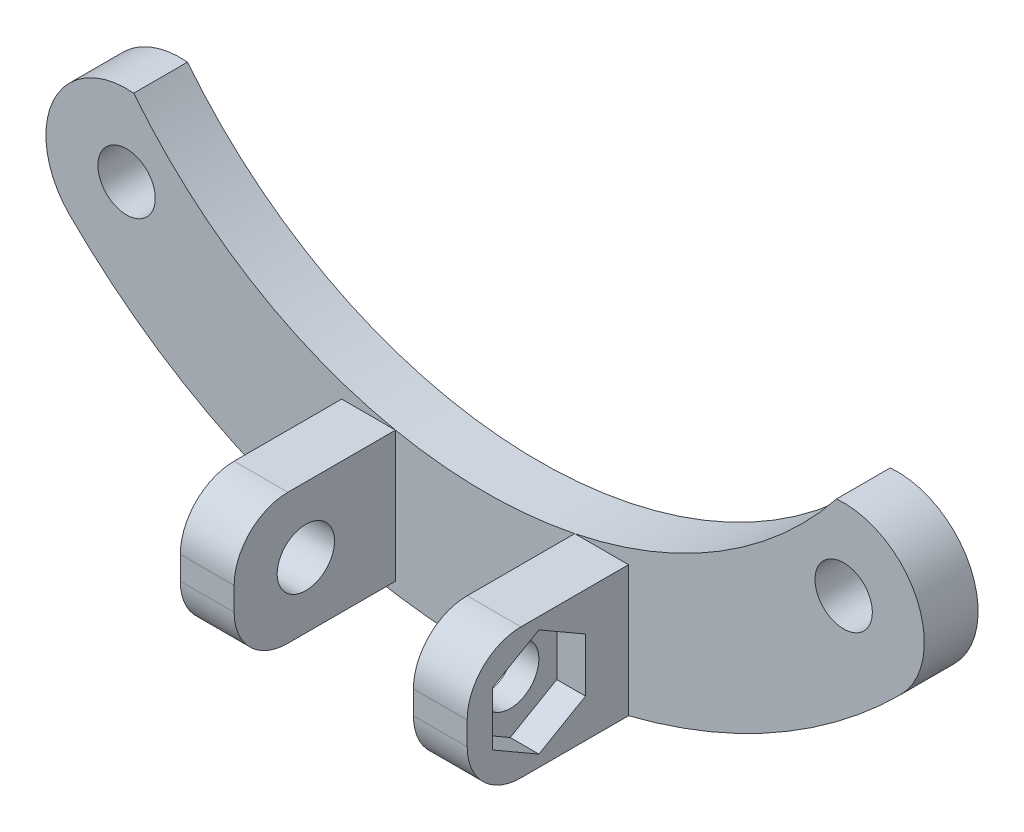
ISO-10303-21;
HEADER;
FILE_DESCRIPTION(('STEP AP214'),'2;1');
FILE_NAME('part.step','',(''),(''),'','','');
FILE_SCHEMA(('AUTOMOTIVE_DESIGN { 1 0 10303 214 1 1 1 1 }'));
ENDSEC;
DATA;
#1=APPLICATION_CONTEXT('core data for automotive mechanical design processes');
#2=APPLICATION_PROTOCOL_DEFINITION('international standard','automotive_design',2000,#1);
#3=PRODUCT_CONTEXT('',#1,'mechanical');
#4=PRODUCT('Part','Part','',(#3));
#5=PRODUCT_RELATED_PRODUCT_CATEGORY('part','',(#4));
#6=PRODUCT_DEFINITION_FORMATION('','',#4);
#7=PRODUCT_DEFINITION_CONTEXT('part definition',#1,'design');
#8=PRODUCT_DEFINITION('design','',#6,#7);
#9=PRODUCT_DEFINITION_SHAPE('','',#8);
#10=(LENGTH_UNIT() NAMED_UNIT(*) SI_UNIT(.MILLI.,.METRE.));
#11=(NAMED_UNIT(*) PLANE_ANGLE_UNIT() SI_UNIT($,.RADIAN.));
#12=(NAMED_UNIT(*) SI_UNIT($,.STERADIAN.) SOLID_ANGLE_UNIT());
#13=UNCERTAINTY_MEASURE_WITH_UNIT(LENGTH_MEASURE(1.E-05),#10,'distance_accuracy_value','');
#14=(GEOMETRIC_REPRESENTATION_CONTEXT(3) GLOBAL_UNCERTAINTY_ASSIGNED_CONTEXT((#13)) GLOBAL_UNIT_ASSIGNED_CONTEXT((#10,
#11,#12)) REPRESENTATION_CONTEXT('',''));
#15=CARTESIAN_POINT('',(0.,0.,0.));
#16=DIRECTION('',(0.,0.,1.));
#17=DIRECTION('',(1.,0.,0.));
#18=AXIS2_PLACEMENT_3D('',#15,#16,#17);
#19=CARTESIAN_POINT('',(32.5254833995939,-8.14489742783178,8.));
#20=DIRECTION('',(-1.,0.,0.));
#21=DIRECTION('',(0.,0.,1.));
#22=AXIS2_PLACEMENT_3D('',#19,#20,#21);
#23=CYLINDRICAL_SURFACE('',#22,1.6);
#24=CARTESIAN_POINT('',(25.,-8.14489742783178,8.));
#25=DIRECTION('',(1.,0.,0.));
#26=DIRECTION('',(0.,0.,-1.));
#27=AXIS2_PLACEMENT_3D('',#24,#25,#26);
#28=CIRCLE('',#27,1.6);
#29=CARTESIAN_POINT('',(25.,-8.14489742783178,6.4));
#30=VERTEX_POINT('',#29);
#31=EDGE_CURVE('E245',#30,#30,#28,.T.);
#32=ORIENTED_EDGE('',*,*,#31,.F.);
#33=EDGE_LOOP('',(#32));
#34=FACE_BOUND('',#33,.T.);
#35=CARTESIAN_POINT('',(26.4,-8.14489742783178,8.));
#36=DIRECTION('',(1.,0.,0.));
#37=DIRECTION('',(0.,0.,-1.));
#38=AXIS2_PLACEMENT_3D('',#35,#36,#37);
#39=CIRCLE('',#38,1.6);
#40=CARTESIAN_POINT('',(26.4,-8.14489742783178,6.4));
#41=VERTEX_POINT('',#40);
#42=EDGE_CURVE('E234',#41,#41,#39,.F.);
#43=ORIENTED_EDGE('',*,*,#42,.F.);
#44=EDGE_LOOP('',(#43));
#45=FACE_BOUND('',#44,.T.);
#46=ADVANCED_FACE('F33',(#34,#45),#23,.F.);
#47=CARTESIAN_POINT('',(30.,10.,3.));
#48=DIRECTION('',(0.,0.,1.));
#49=DIRECTION('',(1.,0.,0.));
#50=AXIS2_PLACEMENT_3D('',#47,#48,#49);
#51=PLANE('',#50);
#52=CARTESIAN_POINT('',(40.,0.,3.));
#53=DIRECTION('',(0.,0.,1.));
#54=DIRECTION('',(1.,0.,0.));
#55=AXIS2_PLACEMENT_3D('',#52,#53,#54);
#56=CIRCLE('',#55,1.6);
#57=CARTESIAN_POINT('',(41.6,0.,3.));
#58=VERTEX_POINT('',#57);
#59=EDGE_CURVE('E302',#58,#58,#56,.T.);
#60=ORIENTED_EDGE('',*,*,#59,.F.);
#61=EDGE_LOOP('',(#60));
#62=FACE_BOUND('',#61,.T.);
#63=DIRECTION('',(-1.,0.,0.));
#64=VECTOR('',#63,1.);
#65=CARTESIAN_POINT('',(28.,-4.49489742783177,3.));
#66=LINE('',#65,#64);
#67=CARTESIAN_POINT('',(28.,-4.49489742783177,3.));
#68=VERTEX_POINT('',#67);
#69=CARTESIAN_POINT('',(25.,-4.49489742783177,3.));
#70=VERTEX_POINT('',#69);
#71=EDGE_CURVE('E260',#68,#70,#66,.T.);
#72=ORIENTED_EDGE('',*,*,#71,.F.);
#73=DIRECTION('',(0.,1.,0.));
#74=VECTOR('',#73,1.);
#75=CARTESIAN_POINT('',(28.,-11.7932137605992,3.));
#76=LINE('',#75,#74);
#77=CARTESIAN_POINT('',(28.,-11.7932137605992,3.));
#78=VERTEX_POINT('',#77);
#79=EDGE_CURVE('E249',#78,#68,#76,.T.);
#80=ORIENTED_EDGE('',*,*,#79,.F.);
#81=CARTESIAN_POINT('',(20.,20.,3.));
#82=DIRECTION('',(0.,0.,1.));
#83=DIRECTION('',(1.,0.,0.));
#84=AXIS2_PLACEMENT_3D('',#81,#82,#83);
#85=CIRCLE('',#84,32.7842712474619);
#86=CARTESIAN_POINT('',(43.1819805153395,-3.18198051533947,3.));
#87=VERTEX_POINT('',#86);
#88=EDGE_CURVE('E319',#78,#87,#85,.T.);
#89=ORIENTED_EDGE('',*,*,#88,.T.);
#90=CARTESIAN_POINT('',(40.,0.,3.));
#91=DIRECTION('',(0.,0.,1.));
#92=DIRECTION('',(1.,0.,0.));
#93=AXIS2_PLACEMENT_3D('',#90,#91,#92);
#94=CIRCLE('',#93,4.5);
#95=CARTESIAN_POINT('',(39.6010286457918,4.48227864579181,3.));
#96=VERTEX_POINT('',#95);
#97=EDGE_CURVE('E317',#87,#96,#94,.T.);
#98=ORIENTED_EDGE('',*,*,#97,.T.);
#99=CARTESIAN_POINT('',(20.,20.,3.));
#100=DIRECTION('',(0.,0.,-1.));
#101=DIRECTION('',(1.,0.,0.));
#102=AXIS2_PLACEMENT_3D('',#99,#100,#101);
#103=CIRCLE('',#102,25.);
#104=EDGE_CURVE('E322',#96,#70,#103,.T.);
#105=ORIENTED_EDGE('',*,*,#104,.T.);
#106=EDGE_LOOP('',(#72,#80,#89,#98,#105));
#107=FACE_BOUND('',#106,.T.);
#108=ADVANCED_FACE('F426',(#62,#107),#51,.T.);
#109=DIRECTION('',(1.,0.,0.));
#110=VECTOR('',#109,1.);
#111=CARTESIAN_POINT('',(28.,-11.7932137605992,3.));
#112=LINE('',#111,#110);
#113=CARTESIAN_POINT('',(25.,-11.7932137605992,3.));
#114=VERTEX_POINT('',#113);
#115=EDGE_CURVE('E254',#114,#78,#112,.T.);
#116=ORIENTED_EDGE('',*,*,#115,.F.);
#117=DIRECTION('',(0.,-1.,0.));
#118=VECTOR('',#117,1.);
#119=CARTESIAN_POINT('',(25.,-11.7932137605992,3.));
#120=LINE('',#119,#118);
#121=EDGE_CURVE('E263',#70,#114,#120,.T.);
#122=ORIENTED_EDGE('',*,*,#121,.F.);
#123=CARTESIAN_POINT('',(15.,-4.49489742783178,3.));
#124=VERTEX_POINT('',#123);
#125=EDGE_CURVE('E326',#70,#124,#103,.T.);
#126=ORIENTED_EDGE('',*,*,#125,.T.);
#127=DIRECTION('',(0.,1.,0.));
#128=VECTOR('',#127,1.);
#129=CARTESIAN_POINT('',(15.,-11.7932137605992,3.));
#130=LINE('',#129,#128);
#131=CARTESIAN_POINT('',(15.,-11.7932137605992,3.));
#132=VERTEX_POINT('',#131);
#133=EDGE_CURVE('E289',#132,#124,#130,.T.);
#134=ORIENTED_EDGE('',*,*,#133,.F.);
#135=DIRECTION('',(1.,0.,0.));
#136=VECTOR('',#135,1.);
#137=CARTESIAN_POINT('',(12.,-11.7932137605992,3.));
#138=LINE('',#137,#136);
#139=CARTESIAN_POINT('',(12.,-11.7932137605992,3.));
#140=VERTEX_POINT('',#139);
#141=EDGE_CURVE('E286',#140,#132,#138,.T.);
#142=ORIENTED_EDGE('',*,*,#141,.F.);
#143=EDGE_CURVE('E318',#140,#78,#85,.T.);
#144=ORIENTED_EDGE('',*,*,#143,.T.);
#145=EDGE_LOOP('',(#116,#122,#126,#134,#142,#144));
#146=FACE_BOUND('',#145,.T.);
#147=ADVANCED_FACE('F410',(#146),#51,.T.);
#148=DIRECTION('',(0.,-1.,0.));
#149=VECTOR('',#148,1.);
#150=CARTESIAN_POINT('',(12.,-11.7932137605992,3.));
#151=LINE('',#150,#149);
#152=CARTESIAN_POINT('',(12.,-4.49489742783177,3.));
#153=VERTEX_POINT('',#152);
#154=EDGE_CURVE('E275',#153,#140,#151,.T.);
#155=ORIENTED_EDGE('',*,*,#154,.F.);
#156=DIRECTION('',(-1.,0.,0.));
#157=VECTOR('',#156,1.);
#158=CARTESIAN_POINT('',(12.,-4.49489742783177,3.));
#159=LINE('',#158,#157);
#160=EDGE_CURVE('E280',#124,#153,#159,.T.);
#161=ORIENTED_EDGE('',*,*,#160,.F.);
#162=CARTESIAN_POINT('',(0.398971354208195,4.48227864579181,3.));
#163=VERTEX_POINT('',#162);
#164=EDGE_CURVE('E321',#124,#163,#103,.T.);
#165=ORIENTED_EDGE('',*,*,#164,.T.);
#166=CARTESIAN_POINT('',(0.,0.,3.));
#167=DIRECTION('',(0.,0.,1.));
#168=DIRECTION('',(1.,0.,0.));
#169=AXIS2_PLACEMENT_3D('',#166,#167,#168);
#170=CIRCLE('',#169,4.5);
#171=CARTESIAN_POINT('',(-3.18198051533947,-3.18198051533946,3.));
#172=VERTEX_POINT('',#171);
#173=EDGE_CURVE('E325',#163,#172,#170,.T.);
#174=ORIENTED_EDGE('',*,*,#173,.T.);
#175=EDGE_CURVE('E314',#172,#140,#85,.T.);
#176=ORIENTED_EDGE('',*,*,#175,.T.);
#177=EDGE_LOOP('',(#155,#161,#165,#174,#176));
#178=FACE_BOUND('',#177,.T.);
#179=CARTESIAN_POINT('',(0.,0.,3.));
#180=DIRECTION('',(0.,0.,1.));
#181=DIRECTION('',(1.,0.,0.));
#182=AXIS2_PLACEMENT_3D('',#179,#180,#181);
#183=CIRCLE('',#182,1.6);
#184=CARTESIAN_POINT('',(1.6,0.,3.));
#185=VERTEX_POINT('',#184);
#186=EDGE_CURVE('E308',#185,#185,#183,.T.);
#187=ORIENTED_EDGE('',*,*,#186,.F.);
#188=EDGE_LOOP('',(#187));
#189=FACE_BOUND('',#188,.T.);
#190=ADVANCED_FACE('F398',(#178,#189),#51,.T.);
#191=CARTESIAN_POINT('',(30.,10.,0.));
#192=DIRECTION('',(0.,0.,1.));
#193=DIRECTION('',(1.,0.,0.));
#194=AXIS2_PLACEMENT_3D('',#191,#192,#193);
#195=PLANE('',#194);
#196=CARTESIAN_POINT('',(0.,0.,0.));
#197=DIRECTION('',(0.,0.,1.));
#198=DIRECTION('',(1.,0.,0.));
#199=AXIS2_PLACEMENT_3D('',#196,#197,#198);
#200=CIRCLE('',#199,1.6);
#201=CARTESIAN_POINT('',(1.6,0.,0.));
#202=VERTEX_POINT('',#201);
#203=EDGE_CURVE('E305',#202,#202,#200,.T.);
#204=ORIENTED_EDGE('',*,*,#203,.T.);
#205=EDGE_LOOP('',(#204));
#206=FACE_BOUND('',#205,.T.);
#207=CARTESIAN_POINT('',(20.,20.,0.));
#208=DIRECTION('',(0.,0.,1.));
#209=DIRECTION('',(1.,0.,0.));
#210=AXIS2_PLACEMENT_3D('',#207,#208,#209);
#211=CIRCLE('',#210,32.7842712474619);
#212=CARTESIAN_POINT('',(-3.18198051533947,-3.18198051533946,0.));
#213=VERTEX_POINT('',#212);
#214=CARTESIAN_POINT('',(43.1819805153395,-3.18198051533947,0.));
#215=VERTEX_POINT('',#214);
#216=EDGE_CURVE('E311',#213,#215,#211,.T.);
#217=ORIENTED_EDGE('',*,*,#216,.F.);
#218=CARTESIAN_POINT('',(0.,0.,0.));
#219=DIRECTION('',(0.,0.,1.));
#220=DIRECTION('',(1.,0.,0.));
#221=AXIS2_PLACEMENT_3D('',#218,#219,#220);
#222=CIRCLE('',#221,4.5);
#223=CARTESIAN_POINT('',(0.398971354208195,4.48227864579181,0.));
#224=VERTEX_POINT('',#223);
#225=EDGE_CURVE('E335',#224,#213,#222,.T.);
#226=ORIENTED_EDGE('',*,*,#225,.F.);
#227=CARTESIAN_POINT('',(20.,20.,0.));
#228=DIRECTION('',(0.,0.,-1.));
#229=DIRECTION('',(1.,0.,0.));
#230=AXIS2_PLACEMENT_3D('',#227,#228,#229);
#231=CIRCLE('',#230,25.);
#232=CARTESIAN_POINT('',(39.6010286457918,4.48227864579181,0.));
#233=VERTEX_POINT('',#232);
#234=EDGE_CURVE('E333',#233,#224,#231,.T.);
#235=ORIENTED_EDGE('',*,*,#234,.F.);
#236=CARTESIAN_POINT('',(40.,0.,0.));
#237=DIRECTION('',(0.,0.,1.));
#238=DIRECTION('',(1.,0.,0.));
#239=AXIS2_PLACEMENT_3D('',#236,#237,#238);
#240=CIRCLE('',#239,4.5);
#241=EDGE_CURVE('E331',#215,#233,#240,.T.);
#242=ORIENTED_EDGE('',*,*,#241,.F.);
#243=EDGE_LOOP('',(#217,#226,#235,#242));
#244=FACE_BOUND('',#243,.T.);
#245=CARTESIAN_POINT('',(40.,0.,0.));
#246=DIRECTION('',(0.,0.,1.));
#247=DIRECTION('',(1.,0.,0.));
#248=AXIS2_PLACEMENT_3D('',#245,#246,#247);
#249=CIRCLE('',#248,1.6);
#250=CARTESIAN_POINT('',(41.6,0.,0.));
#251=VERTEX_POINT('',#250);
#252=EDGE_CURVE('E301',#251,#251,#249,.T.);
#253=ORIENTED_EDGE('',*,*,#252,.T.);
#254=EDGE_LOOP('',(#253));
#255=FACE_BOUND('',#254,.T.);
#256=ADVANCED_FACE('F476',(#206,#244,#255),#195,.F.);
#257=CARTESIAN_POINT('',(20.,20.,3.));
#258=DIRECTION('',(0.,0.,-1.));
#259=DIRECTION('',(-1.,0.,0.));
#260=AXIS2_PLACEMENT_3D('',#257,#258,#259);
#261=CYLINDRICAL_SURFACE('',#260,32.7842712474619);
#262=ORIENTED_EDGE('',*,*,#216,.T.);
#263=DIRECTION('',(0.,0.,-1.));
#264=VECTOR('',#263,1.);
#265=CARTESIAN_POINT('',(43.1819805153395,-3.18198051533947,3.));
#266=LINE('',#265,#264);
#267=EDGE_CURVE('E345',#87,#215,#266,.T.);
#268=ORIENTED_EDGE('',*,*,#267,.F.);
#269=ORIENTED_EDGE('',*,*,#88,.F.);
#270=ORIENTED_EDGE('',*,*,#143,.F.);
#271=ORIENTED_EDGE('',*,*,#175,.F.);
#272=DIRECTION('',(0.,0.,-1.));
#273=VECTOR('',#272,1.);
#274=CARTESIAN_POINT('',(-3.18198051533947,-3.18198051533946,3.));
#275=LINE('',#274,#273);
#276=EDGE_CURVE('E328',#172,#213,#275,.T.);
#277=ORIENTED_EDGE('',*,*,#276,.T.);
#278=EDGE_LOOP('',(#262,#268,#269,#270,#271,#277));
#279=FACE_BOUND('',#278,.T.);
#280=ADVANCED_FACE('F479',(#279),#261,.T.);
#281=CARTESIAN_POINT('',(40.,0.,3.));
#282=DIRECTION('',(0.,0.,-1.));
#283=DIRECTION('',(-1.,0.,0.));
#284=AXIS2_PLACEMENT_3D('',#281,#282,#283);
#285=CYLINDRICAL_SURFACE('',#284,4.5);
#286=ORIENTED_EDGE('',*,*,#241,.T.);
#287=DIRECTION('',(0.,0.,-1.));
#288=VECTOR('',#287,1.);
#289=CARTESIAN_POINT('',(39.6010286457918,4.48227864579181,3.));
#290=LINE('',#289,#288);
#291=EDGE_CURVE('E342',#96,#233,#290,.T.);
#292=ORIENTED_EDGE('',*,*,#291,.F.);
#293=ORIENTED_EDGE('',*,*,#97,.F.);
#294=ORIENTED_EDGE('',*,*,#267,.T.);
#295=EDGE_LOOP('',(#286,#292,#293,#294));
#296=FACE_BOUND('',#295,.T.);
#297=ADVANCED_FACE('F486',(#296),#285,.T.);
#298=CARTESIAN_POINT('',(20.,20.,3.));
#299=DIRECTION('',(0.,0.,-1.));
#300=DIRECTION('',(-1.,0.,0.));
#301=AXIS2_PLACEMENT_3D('',#298,#299,#300);
#302=CYLINDRICAL_SURFACE('',#301,25.);
#303=ORIENTED_EDGE('',*,*,#234,.T.);
#304=DIRECTION('',(0.,0.,-1.));
#305=VECTOR('',#304,1.);
#306=CARTESIAN_POINT('',(0.398971354208195,4.48227864579181,3.));
#307=LINE('',#306,#305);
#308=EDGE_CURVE('E339',#163,#224,#307,.T.);
#309=ORIENTED_EDGE('',*,*,#308,.F.);
#310=ORIENTED_EDGE('',*,*,#164,.F.);
#311=ORIENTED_EDGE('',*,*,#125,.F.);
#312=ORIENTED_EDGE('',*,*,#104,.F.);
#313=ORIENTED_EDGE('',*,*,#291,.T.);
#314=EDGE_LOOP('',(#303,#309,#310,#311,#312,#313));
#315=FACE_BOUND('',#314,.T.);
#316=ADVANCED_FACE('F403',(#315),#302,.F.);
#317=CARTESIAN_POINT('',(0.,0.,3.));
#318=DIRECTION('',(0.,0.,-1.));
#319=DIRECTION('',(-1.,0.,0.));
#320=AXIS2_PLACEMENT_3D('',#317,#318,#319);
#321=CYLINDRICAL_SURFACE('',#320,4.5);
#322=ORIENTED_EDGE('',*,*,#225,.T.);
#323=ORIENTED_EDGE('',*,*,#276,.F.);
#324=ORIENTED_EDGE('',*,*,#173,.F.);
#325=ORIENTED_EDGE('',*,*,#308,.T.);
#326=EDGE_LOOP('',(#322,#323,#324,#325));
#327=FACE_BOUND('',#326,.T.);
#328=ADVANCED_FACE('F473',(#327),#321,.T.);
#329=CARTESIAN_POINT('',(0.,0.,3.));
#330=DIRECTION('',(0.,0.,-1.));
#331=DIRECTION('',(-1.,0.,0.));
#332=AXIS2_PLACEMENT_3D('',#329,#330,#331);
#333=CYLINDRICAL_SURFACE('',#332,1.6);
#334=ORIENTED_EDGE('',*,*,#186,.T.);
#335=EDGE_LOOP('',(#334));
#336=FACE_BOUND('',#335,.T.);
#337=ORIENTED_EDGE('',*,*,#203,.F.);
#338=EDGE_LOOP('',(#337));
#339=FACE_BOUND('',#338,.T.);
#340=ADVANCED_FACE('F470',(#336,#339),#333,.F.);
#341=CARTESIAN_POINT('',(40.,0.,3.));
#342=DIRECTION('',(0.,0.,-1.));
#343=DIRECTION('',(-1.,0.,0.));
#344=AXIS2_PLACEMENT_3D('',#341,#342,#343);
#345=CYLINDRICAL_SURFACE('',#344,1.6);
#346=ORIENTED_EDGE('',*,*,#59,.T.);
#347=EDGE_LOOP('',(#346));
#348=FACE_BOUND('',#347,.T.);
#349=ORIENTED_EDGE('',*,*,#252,.F.);
#350=EDGE_LOOP('',(#349));
#351=FACE_BOUND('',#350,.T.);
#352=ADVANCED_FACE('F466',(#348,#351),#345,.F.);
#353=CARTESIAN_POINT('',(12.,-11.7932137605992,12.));
#354=DIRECTION('',(1.,0.,0.));
#355=DIRECTION('',(0.,0.,-1.));
#356=AXIS2_PLACEMENT_3D('',#353,#354,#355);
#357=PLANE('',#356);
#358=CARTESIAN_POINT('',(12.,-8.14489742783178,8.));
#359=DIRECTION('',(-1.,0.,0.));
#360=DIRECTION('',(0.,0.,1.));
#361=AXIS2_PLACEMENT_3D('',#358,#359,#360);
#362=CIRCLE('',#361,1.6);
#363=CARTESIAN_POINT('',(12.,-8.14489742783178,9.6));
#364=VERTEX_POINT('',#363);
#365=EDGE_CURVE('E242',#364,#364,#362,.T.);
#366=ORIENTED_EDGE('',*,*,#365,.F.);
#367=EDGE_LOOP('',(#366));
#368=FACE_BOUND('',#367,.T.);
#369=DIRECTION('',(0.,-1.,0.));
#370=VECTOR('',#369,1.);
#371=CARTESIAN_POINT('',(12.,-11.7932137605992,12.));
#372=LINE('',#371,#370);
#373=CARTESIAN_POINT('',(12.,-7.49489742783177,12.));
#374=VERTEX_POINT('',#373);
#375=CARTESIAN_POINT('',(12.,-8.79321376059924,12.));
#376=VERTEX_POINT('',#375);
#377=EDGE_CURVE('E276',#374,#376,#372,.T.);
#378=ORIENTED_EDGE('',*,*,#377,.F.);
#379=CARTESIAN_POINT('',(12.,-7.49489742783177,9.));
#380=DIRECTION('',(1.,0.,0.));
#381=DIRECTION('',(0.,0.,-1.));
#382=AXIS2_PLACEMENT_3D('',#379,#380,#381);
#383=CIRCLE('',#382,3.);
#384=CARTESIAN_POINT('',(12.,-4.49489742783177,9.));
#385=VERTEX_POINT('',#384);
#386=EDGE_CURVE('E378',#374,#385,#383,.F.);
#387=ORIENTED_EDGE('',*,*,#386,.T.);
#388=DIRECTION('',(0.,0.,-1.));
#389=VECTOR('',#388,1.);
#390=CARTESIAN_POINT('',(12.,-4.49489742783177,12.));
#391=LINE('',#390,#389);
#392=EDGE_CURVE('E283',#385,#153,#391,.T.);
#393=ORIENTED_EDGE('',*,*,#392,.T.);
#394=ORIENTED_EDGE('',*,*,#154,.T.);
#395=DIRECTION('',(0.,0.,-1.));
#396=VECTOR('',#395,1.);
#397=CARTESIAN_POINT('',(12.,-11.7932137605992,12.));
#398=LINE('',#397,#396);
#399=CARTESIAN_POINT('',(12.,-11.7932137605992,9.));
#400=VERTEX_POINT('',#399);
#401=EDGE_CURVE('E299',#400,#140,#398,.T.);
#402=ORIENTED_EDGE('',*,*,#401,.F.);
#403=CARTESIAN_POINT('',(12.,-8.79321376059924,9.));
#404=DIRECTION('',(1.,0.,0.));
#405=DIRECTION('',(0.,0.,-1.));
#406=AXIS2_PLACEMENT_3D('',#403,#404,#405);
#407=CIRCLE('',#406,3.);
#408=EDGE_CURVE('E376',#400,#376,#407,.F.);
#409=ORIENTED_EDGE('',*,*,#408,.T.);
#410=EDGE_LOOP('',(#378,#387,#393,#394,#402,#409));
#411=FACE_BOUND('',#410,.T.);
#412=ADVANCED_FACE('F391',(#368,#411),#357,.F.);
#413=CARTESIAN_POINT('',(12.,-11.7932137605992,12.));
#414=DIRECTION('',(0.,1.,0.));
#415=DIRECTION('',(0.,0.,1.));
#416=AXIS2_PLACEMENT_3D('',#413,#414,#415);
#417=PLANE('',#416);
#418=DIRECTION('',(0.,0.,-1.));
#419=VECTOR('',#418,1.);
#420=CARTESIAN_POINT('',(15.,-11.7932137605992,12.));
#421=LINE('',#420,#419);
#422=CARTESIAN_POINT('',(15.,-11.7932137605992,9.));
#423=VERTEX_POINT('',#422);
#424=EDGE_CURVE('E297',#423,#132,#421,.T.);
#425=ORIENTED_EDGE('',*,*,#424,.F.);
#426=DIRECTION('',(1.,0.,0.));
#427=VECTOR('',#426,1.);
#428=CARTESIAN_POINT('',(12.,-11.7932137605992,9.));
#429=LINE('',#428,#427);
#430=EDGE_CURVE('E11',#423,#400,#429,.F.);
#431=ORIENTED_EDGE('',*,*,#430,.T.);
#432=ORIENTED_EDGE('',*,*,#401,.T.);
#433=ORIENTED_EDGE('',*,*,#141,.T.);
#434=EDGE_LOOP('',(#425,#431,#432,#433));
#435=FACE_BOUND('',#434,.T.);
#436=ADVANCED_FACE('F415',(#435),#417,.F.);
#437=CARTESIAN_POINT('',(15.,-11.7932137605992,12.));
#438=DIRECTION('',(-1.,0.,0.));
#439=DIRECTION('',(0.,-1.,0.));
#440=AXIS2_PLACEMENT_3D('',#437,#438,#439);
#441=PLANE('',#440);
#442=CARTESIAN_POINT('',(15.,-8.14489742783178,8.));
#443=DIRECTION('',(-1.,0.,0.));
#444=DIRECTION('',(0.,-1.,0.));
#445=AXIS2_PLACEMENT_3D('',#442,#443,#444);
#446=CIRCLE('',#445,1.6);
#447=CARTESIAN_POINT('',(15.,-9.74489742783178,8.));
#448=VERTEX_POINT('',#447);
#449=EDGE_CURVE('E246',#448,#448,#446,.T.);
#450=ORIENTED_EDGE('',*,*,#449,.T.);
#451=EDGE_LOOP('',(#450));
#452=FACE_BOUND('',#451,.T.);
#453=DIRECTION('',(0.,0.,-1.));
#454=VECTOR('',#453,1.);
#455=CARTESIAN_POINT('',(15.,-4.49489742783177,12.));
#456=LINE('',#455,#454);
#457=CARTESIAN_POINT('',(15.,-4.49489742783177,9.));
#458=VERTEX_POINT('',#457);
#459=EDGE_CURVE('E295',#458,#124,#456,.T.);
#460=ORIENTED_EDGE('',*,*,#459,.F.);
#461=CARTESIAN_POINT('',(15.,-7.49489742783177,9.));
#462=DIRECTION('',(-1.,0.,0.));
#463=DIRECTION('',(0.,-1.,0.));
#464=AXIS2_PLACEMENT_3D('',#461,#462,#463);
#465=CIRCLE('',#464,3.);
#466=CARTESIAN_POINT('',(15.,-7.49489742783177,12.));
#467=VERTEX_POINT('',#466);
#468=EDGE_CURVE('E41',#458,#467,#465,.F.);
#469=ORIENTED_EDGE('',*,*,#468,.T.);
#470=DIRECTION('',(0.,1.,0.));
#471=VECTOR('',#470,1.);
#472=CARTESIAN_POINT('',(15.,-11.7932137605992,12.));
#473=LINE('',#472,#471);
#474=CARTESIAN_POINT('',(15.,-8.79321376059924,12.));
#475=VERTEX_POINT('',#474);
#476=EDGE_CURVE('E279',#475,#467,#473,.T.);
#477=ORIENTED_EDGE('',*,*,#476,.F.);
#478=CARTESIAN_POINT('',(15.,-8.79321376059924,9.));
#479=DIRECTION('',(-1.,0.,0.));
#480=DIRECTION('',(0.,-1.,0.));
#481=AXIS2_PLACEMENT_3D('',#478,#479,#480);
#482=CIRCLE('',#481,3.);
#483=EDGE_CURVE('E48',#475,#423,#482,.F.);
#484=ORIENTED_EDGE('',*,*,#483,.T.);
#485=ORIENTED_EDGE('',*,*,#424,.T.);
#486=ORIENTED_EDGE('',*,*,#133,.T.);
#487=EDGE_LOOP('',(#460,#469,#477,#484,#485,#486));
#488=FACE_BOUND('',#487,.T.);
#489=ADVANCED_FACE('F382',(#452,#488),#441,.F.);
#490=CARTESIAN_POINT('',(12.,-4.49489742783177,12.));
#491=DIRECTION('',(0.,-1.,0.));
#492=DIRECTION('',(0.,0.,-1.));
#493=AXIS2_PLACEMENT_3D('',#490,#491,#492);
#494=PLANE('',#493);
#495=ORIENTED_EDGE('',*,*,#392,.F.);
#496=DIRECTION('',(-1.,0.,0.));
#497=VECTOR('',#496,1.);
#498=CARTESIAN_POINT('',(12.,-4.49489742783177,9.));
#499=LINE('',#498,#497);
#500=EDGE_CURVE('E56',#385,#458,#499,.F.);
#501=ORIENTED_EDGE('',*,*,#500,.T.);
#502=ORIENTED_EDGE('',*,*,#459,.T.);
#503=ORIENTED_EDGE('',*,*,#160,.T.);
#504=EDGE_LOOP('',(#495,#501,#502,#503));
#505=FACE_BOUND('',#504,.T.);
#506=ADVANCED_FACE('F393',(#505),#494,.F.);
#507=CARTESIAN_POINT('',(0.,0.,12.));
#508=DIRECTION('',(0.,0.,-1.));
#509=DIRECTION('',(-1.,0.,0.));
#510=AXIS2_PLACEMENT_3D('',#507,#508,#509);
#511=PLANE('',#510);
#512=ORIENTED_EDGE('',*,*,#476,.T.);
#513=DIRECTION('',(-1.,0.,0.));
#514=VECTOR('',#513,1.);
#515=CARTESIAN_POINT('',(0.,-7.49489742783177,12.));
#516=LINE('',#515,#514);
#517=EDGE_CURVE('E373',#467,#374,#516,.T.);
#518=ORIENTED_EDGE('',*,*,#517,.T.);
#519=ORIENTED_EDGE('',*,*,#377,.T.);
#520=DIRECTION('',(1.,0.,0.));
#521=VECTOR('',#520,1.);
#522=CARTESIAN_POINT('',(0.,-8.79321376059924,12.));
#523=LINE('',#522,#521);
#524=EDGE_CURVE('E370',#376,#475,#523,.T.);
#525=ORIENTED_EDGE('',*,*,#524,.T.);
#526=EDGE_LOOP('',(#512,#518,#519,#525));
#527=FACE_BOUND('',#526,.T.);
#528=ADVANCED_FACE('F386',(#527),#511,.F.);
#529=CARTESIAN_POINT('',(28.,-11.7932137605992,12.));
#530=DIRECTION('',(-1.,0.,0.));
#531=DIRECTION('',(0.,0.,1.));
#532=AXIS2_PLACEMENT_3D('',#529,#530,#531);
#533=PLANE('',#532);
#534=DIRECTION('',(0.,1.,0.));
#535=VECTOR('',#534,1.);
#536=CARTESIAN_POINT('',(28.,-9.64489742783177,5.40192378864669));
#537=LINE('',#536,#535);
#538=CARTESIAN_POINT('',(28.,-9.64489742783177,5.40192378864669));
#539=VERTEX_POINT('',#538);
#540=CARTESIAN_POINT('',(28.,-6.64489742783177,5.40192378864668));
#541=VERTEX_POINT('',#540);
#542=EDGE_CURVE('E222',#539,#541,#537,.T.);
#543=ORIENTED_EDGE('',*,*,#542,.F.);
#544=DIRECTION('',(0.,0.5,-0.866025403784439));
#545=VECTOR('',#544,1.);
#546=CARTESIAN_POINT('',(28.,-11.1448974278318,8.00000000000001));
#547=LINE('',#546,#545);
#548=CARTESIAN_POINT('',(28.,-11.1448974278318,8.00000000000001));
#549=VERTEX_POINT('',#548);
#550=EDGE_CURVE('E189',#549,#539,#547,.T.);
#551=ORIENTED_EDGE('',*,*,#550,.F.);
#552=DIRECTION('',(0.,-0.5,-0.866025403784439));
#553=VECTOR('',#552,1.);
#554=CARTESIAN_POINT('',(28.,-9.64489742783178,10.5980762113533));
#555=LINE('',#554,#553);
#556=CARTESIAN_POINT('',(28.,-9.64489742783178,10.5980762113533));
#557=VERTEX_POINT('',#556);
#558=EDGE_CURVE('E208',#557,#549,#555,.T.);
#559=ORIENTED_EDGE('',*,*,#558,.F.);
#560=DIRECTION('',(0.,-1.,0.));
#561=VECTOR('',#560,1.);
#562=CARTESIAN_POINT('',(28.,-6.64489742783177,10.5980762113533));
#563=LINE('',#562,#561);
#564=CARTESIAN_POINT('',(28.,-6.64489742783177,10.5980762113533));
#565=VERTEX_POINT('',#564);
#566=EDGE_CURVE('E211',#565,#557,#563,.T.);
#567=ORIENTED_EDGE('',*,*,#566,.F.);
#568=DIRECTION('',(0.,-0.5,0.866025403784439));
#569=VECTOR('',#568,1.);
#570=CARTESIAN_POINT('',(28.,-5.14489742783177,8.));
#571=LINE('',#570,#569);
#572=CARTESIAN_POINT('',(28.,-5.14489742783177,8.));
#573=VERTEX_POINT('',#572);
#574=EDGE_CURVE('E227',#573,#565,#571,.T.);
#575=ORIENTED_EDGE('',*,*,#574,.F.);
#576=DIRECTION('',(0.,0.5,0.866025403784439));
#577=VECTOR('',#576,1.);
#578=CARTESIAN_POINT('',(28.,-6.64489742783177,5.40192378864668));
#579=LINE('',#578,#577);
#580=EDGE_CURVE('E224',#541,#573,#579,.T.);
#581=ORIENTED_EDGE('',*,*,#580,.F.);
#582=EDGE_LOOP('',(#543,#551,#559,#567,#575,#581));
#583=FACE_BOUND('',#582,.T.);
#584=DIRECTION('',(0.,1.,0.));
#585=VECTOR('',#584,1.);
#586=CARTESIAN_POINT('',(28.,-11.7932137605992,12.));
#587=LINE('',#586,#585);
#588=CARTESIAN_POINT('',(28.,-8.79321376059924,12.));
#589=VERTEX_POINT('',#588);
#590=CARTESIAN_POINT('',(28.,-7.49489742783177,12.));
#591=VERTEX_POINT('',#590);
#592=EDGE_CURVE('E250',#589,#591,#587,.T.);
#593=ORIENTED_EDGE('',*,*,#592,.F.);
#594=CARTESIAN_POINT('',(28.,-8.79321376059924,9.));
#595=DIRECTION('',(-1.,0.,0.));
#596=DIRECTION('',(0.,0.,1.));
#597=AXIS2_PLACEMENT_3D('',#594,#595,#596);
#598=CIRCLE('',#597,3.);
#599=CARTESIAN_POINT('',(28.,-11.7932137605992,9.));
#600=VERTEX_POINT('',#599);
#601=EDGE_CURVE('E360',#589,#600,#598,.F.);
#602=ORIENTED_EDGE('',*,*,#601,.T.);
#603=DIRECTION('',(0.,0.,-1.));
#604=VECTOR('',#603,1.);
#605=CARTESIAN_POINT('',(28.,-11.7932137605992,12.));
#606=LINE('',#605,#604);
#607=EDGE_CURVE('E257',#600,#78,#606,.T.);
#608=ORIENTED_EDGE('',*,*,#607,.T.);
#609=ORIENTED_EDGE('',*,*,#79,.T.);
#610=DIRECTION('',(0.,0.,-1.));
#611=VECTOR('',#610,1.);
#612=CARTESIAN_POINT('',(28.,-4.49489742783177,12.));
#613=LINE('',#612,#611);
#614=CARTESIAN_POINT('',(28.,-4.49489742783177,9.));
#615=VERTEX_POINT('',#614);
#616=EDGE_CURVE('E273',#615,#68,#613,.T.);
#617=ORIENTED_EDGE('',*,*,#616,.F.);
#618=CARTESIAN_POINT('',(28.,-7.49489742783177,9.));
#619=DIRECTION('',(-1.,0.,0.));
#620=DIRECTION('',(0.,0.,1.));
#621=AXIS2_PLACEMENT_3D('',#618,#619,#620);
#622=CIRCLE('',#621,3.);
#623=EDGE_CURVE('E358',#615,#591,#622,.F.);
#624=ORIENTED_EDGE('',*,*,#623,.T.);
#625=EDGE_LOOP('',(#593,#602,#608,#609,#617,#624));
#626=FACE_BOUND('',#625,.T.);
#627=ADVANCED_FACE('F507',(#583,#626),#533,.F.);
#628=CARTESIAN_POINT('',(28.,-4.49489742783177,12.));
#629=DIRECTION('',(0.,-1.,0.));
#630=DIRECTION('',(0.,0.,-1.));
#631=AXIS2_PLACEMENT_3D('',#628,#629,#630);
#632=PLANE('',#631);
#633=DIRECTION('',(0.,0.,-1.));
#634=VECTOR('',#633,1.);
#635=CARTESIAN_POINT('',(25.,-4.49489742783177,12.));
#636=LINE('',#635,#634);
#637=CARTESIAN_POINT('',(25.,-4.49489742783177,9.));
#638=VERTEX_POINT('',#637);
#639=EDGE_CURVE('E271',#638,#70,#636,.T.);
#640=ORIENTED_EDGE('',*,*,#639,.F.);
#641=DIRECTION('',(-1.,0.,0.));
#642=VECTOR('',#641,1.);
#643=CARTESIAN_POINT('',(28.,-4.49489742783177,9.));
#644=LINE('',#643,#642);
#645=EDGE_CURVE('E368',#638,#615,#644,.F.);
#646=ORIENTED_EDGE('',*,*,#645,.T.);
#647=ORIENTED_EDGE('',*,*,#616,.T.);
#648=ORIENTED_EDGE('',*,*,#71,.T.);
#649=EDGE_LOOP('',(#640,#646,#647,#648));
#650=FACE_BOUND('',#649,.T.);
#651=ADVANCED_FACE('F533',(#650),#632,.F.);
#652=CARTESIAN_POINT('',(25.,-11.7932137605992,12.));
#653=DIRECTION('',(1.,0.,0.));
#654=DIRECTION('',(0.,0.,-1.));
#655=AXIS2_PLACEMENT_3D('',#652,#653,#654);
#656=PLANE('',#655);
#657=ORIENTED_EDGE('',*,*,#31,.T.);
#658=EDGE_LOOP('',(#657));
#659=FACE_BOUND('',#658,.T.);
#660=DIRECTION('',(0.,0.,-1.));
#661=VECTOR('',#660,1.);
#662=CARTESIAN_POINT('',(25.,-11.7932137605992,12.));
#663=LINE('',#662,#661);
#664=CARTESIAN_POINT('',(25.,-11.7932137605992,9.));
#665=VERTEX_POINT('',#664);
#666=EDGE_CURVE('E269',#665,#114,#663,.T.);
#667=ORIENTED_EDGE('',*,*,#666,.F.);
#668=CARTESIAN_POINT('',(25.,-8.79321376059924,9.));
#669=DIRECTION('',(1.,0.,0.));
#670=DIRECTION('',(0.,0.,-1.));
#671=AXIS2_PLACEMENT_3D('',#668,#669,#670);
#672=CIRCLE('',#671,3.);
#673=CARTESIAN_POINT('',(25.,-8.79321376059924,12.));
#674=VERTEX_POINT('',#673);
#675=EDGE_CURVE('E366',#665,#674,#672,.F.);
#676=ORIENTED_EDGE('',*,*,#675,.T.);
#677=DIRECTION('',(0.,-1.,0.));
#678=VECTOR('',#677,1.);
#679=CARTESIAN_POINT('',(25.,-11.7932137605992,12.));
#680=LINE('',#679,#678);
#681=CARTESIAN_POINT('',(25.,-7.49489742783177,12.));
#682=VERTEX_POINT('',#681);
#683=EDGE_CURVE('E253',#682,#674,#680,.T.);
#684=ORIENTED_EDGE('',*,*,#683,.F.);
#685=CARTESIAN_POINT('',(25.,-7.49489742783177,9.));
#686=DIRECTION('',(1.,0.,0.));
#687=DIRECTION('',(0.,0.,-1.));
#688=AXIS2_PLACEMENT_3D('',#685,#686,#687);
#689=CIRCLE('',#688,3.);
#690=EDGE_CURVE('E364',#682,#638,#689,.F.);
#691=ORIENTED_EDGE('',*,*,#690,.T.);
#692=ORIENTED_EDGE('',*,*,#639,.T.);
#693=ORIENTED_EDGE('',*,*,#121,.T.);
#694=EDGE_LOOP('',(#667,#676,#684,#691,#692,#693));
#695=FACE_BOUND('',#694,.T.);
#696=ADVANCED_FACE('F535',(#659,#695),#656,.F.);
#697=CARTESIAN_POINT('',(28.,-11.7932137605992,12.));
#698=DIRECTION('',(0.,1.,0.));
#699=DIRECTION('',(0.,0.,1.));
#700=AXIS2_PLACEMENT_3D('',#697,#698,#699);
#701=PLANE('',#700);
#702=ORIENTED_EDGE('',*,*,#607,.F.);
#703=DIRECTION('',(1.,0.,0.));
#704=VECTOR('',#703,1.);
#705=CARTESIAN_POINT('',(25.,-11.7932137605992,9.));
#706=LINE('',#705,#704);
#707=EDGE_CURVE('E362',#600,#665,#706,.F.);
#708=ORIENTED_EDGE('',*,*,#707,.T.);
#709=ORIENTED_EDGE('',*,*,#666,.T.);
#710=ORIENTED_EDGE('',*,*,#115,.T.);
#711=EDGE_LOOP('',(#702,#708,#709,#710));
#712=FACE_BOUND('',#711,.T.);
#713=ADVANCED_FACE('F448',(#712),#701,.F.);
#714=CARTESIAN_POINT('',(0.,0.,12.));
#715=DIRECTION('',(0.,0.,1.));
#716=DIRECTION('',(1.,0.,0.));
#717=AXIS2_PLACEMENT_3D('',#714,#715,#716);
#718=PLANE('',#717);
#719=ORIENTED_EDGE('',*,*,#683,.T.);
#720=DIRECTION('',(1.,0.,0.));
#721=VECTOR('',#720,1.);
#722=CARTESIAN_POINT('',(28.,-8.79321376059924,12.));
#723=LINE('',#722,#721);
#724=EDGE_CURVE('E355',#674,#589,#723,.T.);
#725=ORIENTED_EDGE('',*,*,#724,.T.);
#726=ORIENTED_EDGE('',*,*,#592,.T.);
#727=DIRECTION('',(-1.,0.,0.));
#728=VECTOR('',#727,1.);
#729=CARTESIAN_POINT('',(25.,-7.49489742783177,12.));
#730=LINE('',#729,#728);
#731=EDGE_CURVE('E348',#591,#682,#730,.T.);
#732=ORIENTED_EDGE('',*,*,#731,.T.);
#733=EDGE_LOOP('',(#719,#725,#726,#732));
#734=FACE_BOUND('',#733,.T.);
#735=ADVANCED_FACE('F440',(#734),#718,.T.);
#736=ORIENTED_EDGE('',*,*,#365,.T.);
#737=EDGE_LOOP('',(#736));
#738=FACE_BOUND('',#737,.T.);
#739=ORIENTED_EDGE('',*,*,#449,.F.);
#740=EDGE_LOOP('',(#739));
#741=FACE_BOUND('',#740,.T.);
#742=ADVANCED_FACE('F429',(#738,#741),#23,.F.);
#743=CARTESIAN_POINT('',(26.4,0.,0.));
#744=DIRECTION('',(1.,0.,0.));
#745=DIRECTION('',(0.,0.,-1.));
#746=AXIS2_PLACEMENT_3D('',#743,#744,#745);
#747=PLANE('',#746);
#748=DIRECTION('',(0.,0.5,-0.866025403784439));
#749=VECTOR('',#748,1.);
#750=CARTESIAN_POINT('',(26.4,-11.1448974278318,8.00000000000001));
#751=LINE('',#750,#749);
#752=CARTESIAN_POINT('',(26.4,-11.1448974278318,8.00000000000001));
#753=VERTEX_POINT('',#752);
#754=CARTESIAN_POINT('',(26.4,-9.64489742783177,5.40192378864669));
#755=VERTEX_POINT('',#754);
#756=EDGE_CURVE('E186',#753,#755,#751,.T.);
#757=ORIENTED_EDGE('',*,*,#756,.T.);
#758=DIRECTION('',(0.,1.,0.));
#759=VECTOR('',#758,1.);
#760=CARTESIAN_POINT('',(26.4,-9.64489742783177,5.40192378864669));
#761=LINE('',#760,#759);
#762=CARTESIAN_POINT('',(26.4,-6.64489742783177,5.40192378864668));
#763=VERTEX_POINT('',#762);
#764=EDGE_CURVE('E197',#755,#763,#761,.T.);
#765=ORIENTED_EDGE('',*,*,#764,.T.);
#766=DIRECTION('',(0.,0.5,0.866025403784439));
#767=VECTOR('',#766,1.);
#768=CARTESIAN_POINT('',(26.4,-6.64489742783177,5.40192378864668));
#769=LINE('',#768,#767);
#770=CARTESIAN_POINT('',(26.4,-5.14489742783177,8.));
#771=VERTEX_POINT('',#770);
#772=EDGE_CURVE('E202',#763,#771,#769,.T.);
#773=ORIENTED_EDGE('',*,*,#772,.T.);
#774=DIRECTION('',(0.,-0.5,0.866025403784439));
#775=VECTOR('',#774,1.);
#776=CARTESIAN_POINT('',(26.4,-5.14489742783177,8.));
#777=LINE('',#776,#775);
#778=CARTESIAN_POINT('',(26.4,-6.64489742783177,10.5980762113533));
#779=VERTEX_POINT('',#778);
#780=EDGE_CURVE('E215',#771,#779,#777,.T.);
#781=ORIENTED_EDGE('',*,*,#780,.T.);
#782=DIRECTION('',(0.,-1.,0.));
#783=VECTOR('',#782,1.);
#784=CARTESIAN_POINT('',(26.4,-6.64489742783177,10.5980762113533));
#785=LINE('',#784,#783);
#786=CARTESIAN_POINT('',(26.4,-9.64489742783178,10.5980762113533));
#787=VERTEX_POINT('',#786);
#788=EDGE_CURVE('E218',#779,#787,#785,.T.);
#789=ORIENTED_EDGE('',*,*,#788,.T.);
#790=DIRECTION('',(0.,-0.5,-0.866025403784439));
#791=VECTOR('',#790,1.);
#792=CARTESIAN_POINT('',(26.4,-9.64489742783178,10.5980762113533));
#793=LINE('',#792,#791);
#794=EDGE_CURVE('E194',#787,#753,#793,.T.);
#795=ORIENTED_EDGE('',*,*,#794,.T.);
#796=EDGE_LOOP('',(#757,#765,#773,#781,#789,#795));
#797=FACE_BOUND('',#796,.T.);
#798=ORIENTED_EDGE('',*,*,#42,.T.);
#799=EDGE_LOOP('',(#798));
#800=FACE_BOUND('',#799,.T.);
#801=ADVANCED_FACE('F204',(#797,#800),#747,.T.);
#802=CARTESIAN_POINT('',(26.4,-11.1448974278318,8.00000000000001));
#803=DIRECTION('',(0.,-0.866025403784439,-0.5));
#804=DIRECTION('',(0.,0.5,-0.866025403784439));
#805=AXIS2_PLACEMENT_3D('',#802,#803,#804);
#806=PLANE('',#805);
#807=ORIENTED_EDGE('',*,*,#550,.T.);
#808=DIRECTION('',(1.,0.,0.));
#809=VECTOR('',#808,1.);
#810=CARTESIAN_POINT('',(26.4,-9.64489742783177,5.40192378864669));
#811=LINE('',#810,#809);
#812=EDGE_CURVE('E182',#755,#539,#811,.T.);
#813=ORIENTED_EDGE('',*,*,#812,.F.);
#814=ORIENTED_EDGE('',*,*,#756,.F.);
#815=DIRECTION('',(1.,0.,0.));
#816=VECTOR('',#815,1.);
#817=CARTESIAN_POINT('',(26.4,-11.1448974278318,8.00000000000001));
#818=LINE('',#817,#816);
#819=EDGE_CURVE('E232',#753,#549,#818,.T.);
#820=ORIENTED_EDGE('',*,*,#819,.T.);
#821=EDGE_LOOP('',(#807,#813,#814,#820));
#822=FACE_BOUND('',#821,.T.);
#823=ADVANCED_FACE('F184',(#822),#806,.F.);
#824=CARTESIAN_POINT('',(26.4,-9.64489742783178,10.5980762113533));
#825=DIRECTION('',(0.,-0.866025403784439,0.5));
#826=DIRECTION('',(0.,-0.5,-0.866025403784439));
#827=AXIS2_PLACEMENT_3D('',#824,#825,#826);
#828=PLANE('',#827);
#829=ORIENTED_EDGE('',*,*,#558,.T.);
#830=ORIENTED_EDGE('',*,*,#819,.F.);
#831=ORIENTED_EDGE('',*,*,#794,.F.);
#832=DIRECTION('',(1.,0.,0.));
#833=VECTOR('',#832,1.);
#834=CARTESIAN_POINT('',(26.4,-9.64489742783178,10.5980762113533));
#835=LINE('',#834,#833);
#836=EDGE_CURVE('E235',#787,#557,#835,.T.);
#837=ORIENTED_EDGE('',*,*,#836,.T.);
#838=EDGE_LOOP('',(#829,#830,#831,#837));
#839=FACE_BOUND('',#838,.T.);
#840=ADVANCED_FACE('F628',(#839),#828,.F.);
#841=CARTESIAN_POINT('',(26.4,-6.64489742783177,10.5980762113533));
#842=DIRECTION('',(0.,0.,1.));
#843=DIRECTION('',(1.,0.,0.));
#844=AXIS2_PLACEMENT_3D('',#841,#842,#843);
#845=PLANE('',#844);
#846=ORIENTED_EDGE('',*,*,#566,.T.);
#847=ORIENTED_EDGE('',*,*,#836,.F.);
#848=ORIENTED_EDGE('',*,*,#788,.F.);
#849=DIRECTION('',(1.,0.,0.));
#850=VECTOR('',#849,1.);
#851=CARTESIAN_POINT('',(26.4,-6.64489742783177,10.5980762113533));
#852=LINE('',#851,#850);
#853=EDGE_CURVE('E237',#779,#565,#852,.T.);
#854=ORIENTED_EDGE('',*,*,#853,.T.);
#855=EDGE_LOOP('',(#846,#847,#848,#854));
#856=FACE_BOUND('',#855,.T.);
#857=ADVANCED_FACE('F620',(#856),#845,.F.);
#858=CARTESIAN_POINT('',(26.4,-5.14489742783177,8.));
#859=DIRECTION('',(0.,0.866025403784439,0.5));
#860=DIRECTION('',(0.,-0.5,0.866025403784439));
#861=AXIS2_PLACEMENT_3D('',#858,#859,#860);
#862=PLANE('',#861);
#863=ORIENTED_EDGE('',*,*,#574,.T.);
#864=ORIENTED_EDGE('',*,*,#853,.F.);
#865=ORIENTED_EDGE('',*,*,#780,.F.);
#866=DIRECTION('',(1.,0.,0.));
#867=VECTOR('',#866,1.);
#868=CARTESIAN_POINT('',(26.4,-5.14489742783177,8.));
#869=LINE('',#868,#867);
#870=EDGE_CURVE('E239',#771,#573,#869,.T.);
#871=ORIENTED_EDGE('',*,*,#870,.T.);
#872=EDGE_LOOP('',(#863,#864,#865,#871));
#873=FACE_BOUND('',#872,.T.);
#874=ADVANCED_FACE('F612',(#873),#862,.F.);
#875=CARTESIAN_POINT('',(26.4,-6.64489742783177,5.40192378864668));
#876=DIRECTION('',(0.,0.866025403784439,-0.5));
#877=DIRECTION('',(0.,0.5,0.866025403784439));
#878=AXIS2_PLACEMENT_3D('',#875,#876,#877);
#879=PLANE('',#878);
#880=ORIENTED_EDGE('',*,*,#580,.T.);
#881=ORIENTED_EDGE('',*,*,#870,.F.);
#882=ORIENTED_EDGE('',*,*,#772,.F.);
#883=DIRECTION('',(1.,0.,0.));
#884=VECTOR('',#883,1.);
#885=CARTESIAN_POINT('',(26.4,-6.64489742783177,5.40192378864668));
#886=LINE('',#885,#884);
#887=EDGE_CURVE('E193',#763,#541,#886,.T.);
#888=ORIENTED_EDGE('',*,*,#887,.T.);
#889=EDGE_LOOP('',(#880,#881,#882,#888));
#890=FACE_BOUND('',#889,.T.);
#891=ADVANCED_FACE('F606',(#890),#879,.F.);
#892=CARTESIAN_POINT('',(26.4,-9.64489742783177,5.40192378864669));
#893=DIRECTION('',(0.,0.,-1.));
#894=DIRECTION('',(0.,1.,0.));
#895=AXIS2_PLACEMENT_3D('',#892,#893,#894);
#896=PLANE('',#895);
#897=ORIENTED_EDGE('',*,*,#542,.T.);
#898=ORIENTED_EDGE('',*,*,#887,.F.);
#899=ORIENTED_EDGE('',*,*,#764,.F.);
#900=ORIENTED_EDGE('',*,*,#812,.T.);
#901=EDGE_LOOP('',(#897,#898,#899,#900));
#902=FACE_BOUND('',#901,.T.);
#903=ADVANCED_FACE('F198',(#902),#896,.F.);
#904=CARTESIAN_POINT('',(0.,-8.79321376059924,9.));
#905=DIRECTION('',(-1.,0.,0.));
#906=DIRECTION('',(0.,0.,1.));
#907=AXIS2_PLACEMENT_3D('',#904,#905,#906);
#908=CYLINDRICAL_SURFACE('',#907,3.);
#909=ORIENTED_EDGE('',*,*,#675,.F.);
#910=ORIENTED_EDGE('',*,*,#707,.F.);
#911=ORIENTED_EDGE('',*,*,#601,.F.);
#912=ORIENTED_EDGE('',*,*,#724,.F.);
#913=EDGE_LOOP('',(#909,#910,#911,#912));
#914=FACE_BOUND('',#913,.T.);
#915=ADVANCED_FACE('F493',(#914),#908,.T.);
#916=CARTESIAN_POINT('',(0.,-7.49489742783177,9.));
#917=DIRECTION('',(1.,0.,0.));
#918=DIRECTION('',(0.,0.,-1.));
#919=AXIS2_PLACEMENT_3D('',#916,#917,#918);
#920=CYLINDRICAL_SURFACE('',#919,3.);
#921=ORIENTED_EDGE('',*,*,#623,.F.);
#922=ORIENTED_EDGE('',*,*,#645,.F.);
#923=ORIENTED_EDGE('',*,*,#690,.F.);
#924=ORIENTED_EDGE('',*,*,#731,.F.);
#925=EDGE_LOOP('',(#921,#922,#923,#924));
#926=FACE_BOUND('',#925,.T.);
#927=ADVANCED_FACE('F424',(#926),#920,.T.);
#928=CARTESIAN_POINT('',(0.,-7.49489742783177,9.));
#929=DIRECTION('',(-1.,0.,0.));
#930=DIRECTION('',(0.,0.,1.));
#931=AXIS2_PLACEMENT_3D('',#928,#929,#930);
#932=CYLINDRICAL_SURFACE('',#931,3.);
#933=ORIENTED_EDGE('',*,*,#468,.F.);
#934=ORIENTED_EDGE('',*,*,#500,.F.);
#935=ORIENTED_EDGE('',*,*,#386,.F.);
#936=ORIENTED_EDGE('',*,*,#517,.F.);
#937=EDGE_LOOP('',(#933,#934,#935,#936));
#938=FACE_BOUND('',#937,.T.);
#939=ADVANCED_FACE('F389',(#938),#932,.T.);
#940=CARTESIAN_POINT('',(0.,-8.79321376059924,9.));
#941=DIRECTION('',(1.,0.,0.));
#942=DIRECTION('',(0.,0.,-1.));
#943=AXIS2_PLACEMENT_3D('',#940,#941,#942);
#944=CYLINDRICAL_SURFACE('',#943,3.);
#945=ORIENTED_EDGE('',*,*,#408,.F.);
#946=ORIENTED_EDGE('',*,*,#430,.F.);
#947=ORIENTED_EDGE('',*,*,#483,.F.);
#948=ORIENTED_EDGE('',*,*,#524,.F.);
#949=EDGE_LOOP('',(#945,#946,#947,#948));
#950=FACE_BOUND('',#949,.T.);
#951=ADVANCED_FACE('F35',(#950),#944,.T.);
#952=CLOSED_SHELL('',(#46,#108,#147,#190,#256,#280,#297,#316,#328,#340,#352,#412,#436,#489,#506,
#528,#627,#651,#696,#713,#735,#742,#801,#823,#840,#857,#874,#891,#903,#915,#927,#939,#951));
#953=MANIFOLD_SOLID_BREP('B2',#952);
#954=ADVANCED_BREP_SHAPE_REPRESENTATION('',(#18,#953),#14);
#955=SHAPE_DEFINITION_REPRESENTATION(#9,#954);
ENDSEC;
END-ISO-10303-21;
